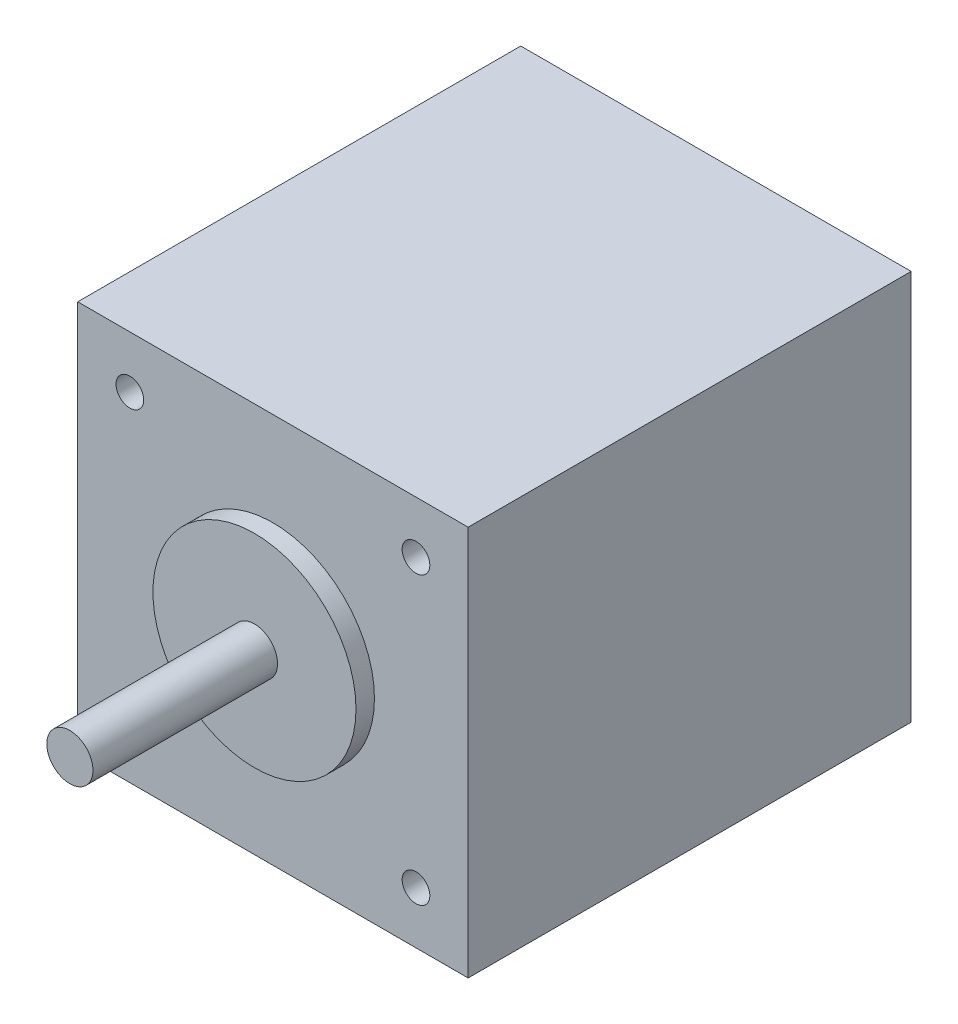
ISO-10303-21;
HEADER;
FILE_DESCRIPTION(('STEP AP214'),'2;1');
FILE_NAME('part.step','',(''),(''),'','','');
FILE_SCHEMA(('AUTOMOTIVE_DESIGN { 1 0 10303 214 1 1 1 1 }'));
ENDSEC;
DATA;
#1=APPLICATION_CONTEXT('core data for automotive mechanical design processes');
#2=APPLICATION_PROTOCOL_DEFINITION('international standard','automotive_design',2000,#1);
#3=PRODUCT_CONTEXT('',#1,'mechanical');
#4=PRODUCT('Part','Part','',(#3));
#5=PRODUCT_RELATED_PRODUCT_CATEGORY('part','',(#4));
#6=PRODUCT_DEFINITION_FORMATION('','',#4);
#7=PRODUCT_DEFINITION_CONTEXT('part definition',#1,'design');
#8=PRODUCT_DEFINITION('design','',#6,#7);
#9=PRODUCT_DEFINITION_SHAPE('','',#8);
#10=(LENGTH_UNIT() NAMED_UNIT(*) SI_UNIT(.MILLI.,.METRE.));
#11=(NAMED_UNIT(*) PLANE_ANGLE_UNIT() SI_UNIT($,.RADIAN.));
#12=(NAMED_UNIT(*) SI_UNIT($,.STERADIAN.) SOLID_ANGLE_UNIT());
#13=UNCERTAINTY_MEASURE_WITH_UNIT(LENGTH_MEASURE(1.E-05),#10,'distance_accuracy_value','');
#14=(GEOMETRIC_REPRESENTATION_CONTEXT(3) GLOBAL_UNCERTAINTY_ASSIGNED_CONTEXT((#13)) GLOBAL_UNIT_ASSIGNED_CONTEXT((#10,
#11,#12)) REPRESENTATION_CONTEXT('',''));
#15=CARTESIAN_POINT('',(0.,0.,0.));
#16=DIRECTION('',(0.,0.,1.));
#17=DIRECTION('',(1.,0.,0.));
#18=AXIS2_PLACEMENT_3D('',#15,#16,#17);
#19=CARTESIAN_POINT('',(0.,0.,22.));
#20=DIRECTION('',(0.,0.,1.));
#21=DIRECTION('',(1.,0.,0.));
#22=AXIS2_PLACEMENT_3D('',#19,#20,#21);
#23=PLANE('',#22);
#24=CARTESIAN_POINT('',(0.,0.,22.));
#25=DIRECTION('',(0.,0.,1.));
#26=DIRECTION('',(1.,0.,0.));
#27=AXIS2_PLACEMENT_3D('',#24,#25,#26);
#28=CIRCLE('',#27,2.5);
#29=CARTESIAN_POINT('',(2.5,0.,22.));
#30=VERTEX_POINT('',#29);
#31=EDGE_CURVE('E20',#30,#30,#28,.F.);
#32=ORIENTED_EDGE('',*,*,#31,.F.);
#33=EDGE_LOOP('',(#32));
#34=FACE_BOUND('',#33,.T.);
#35=ADVANCED_FACE('F17',(#34),#23,.T.);
#36=CARTESIAN_POINT('',(0.,0.,0.));
#37=DIRECTION('',(0.,0.,1.));
#38=DIRECTION('',(1.,0.,0.));
#39=AXIS2_PLACEMENT_3D('',#36,#37,#38);
#40=CYLINDRICAL_SURFACE('',#39,2.5);
#41=CARTESIAN_POINT('',(0.,0.,2.));
#42=DIRECTION('',(0.,0.,1.));
#43=DIRECTION('',(1.,0.,0.));
#44=AXIS2_PLACEMENT_3D('',#41,#42,#43);
#45=CIRCLE('',#44,2.5);
#46=CARTESIAN_POINT('',(2.5,0.,2.));
#47=VERTEX_POINT('',#46);
#48=EDGE_CURVE('E111',#47,#47,#45,.F.);
#49=ORIENTED_EDGE('',*,*,#48,.F.);
#50=EDGE_LOOP('',(#49));
#51=FACE_BOUND('',#50,.T.);
#52=ORIENTED_EDGE('',*,*,#31,.T.);
#53=EDGE_LOOP('',(#52));
#54=FACE_BOUND('',#53,.T.);
#55=ADVANCED_FACE('F118',(#51,#54),#40,.T.);
#56=CARTESIAN_POINT('',(0.,0.,2.));
#57=DIRECTION('',(0.,0.,1.));
#58=DIRECTION('',(1.,0.,0.));
#59=AXIS2_PLACEMENT_3D('',#56,#57,#58);
#60=PLANE('',#59);
#61=ORIENTED_EDGE('',*,*,#48,.T.);
#62=EDGE_LOOP('',(#61));
#63=FACE_BOUND('',#62,.T.);
#64=CARTESIAN_POINT('',(0.,0.,2.));
#65=DIRECTION('',(0.,0.,1.));
#66=DIRECTION('',(1.,0.,0.));
#67=AXIS2_PLACEMENT_3D('',#64,#65,#66);
#68=CIRCLE('',#67,11.);
#69=CARTESIAN_POINT('',(11.,0.,2.));
#70=VERTEX_POINT('',#69);
#71=EDGE_CURVE('E109',#70,#70,#68,.F.);
#72=ORIENTED_EDGE('',*,*,#71,.F.);
#73=EDGE_LOOP('',(#72));
#74=FACE_BOUND('',#73,.T.);
#75=ADVANCED_FACE('F125',(#63,#74),#60,.T.);
#76=CARTESIAN_POINT('',(15.5,15.5,-5.));
#77=DIRECTION('',(0.,0.,1.));
#78=DIRECTION('',(1.,0.,0.));
#79=AXIS2_PLACEMENT_3D('',#76,#77,#78);
#80=PLANE('',#79);
#81=CARTESIAN_POINT('',(15.5,15.5,-5.));
#82=DIRECTION('',(0.,0.,-1.));
#83=DIRECTION('',(-1.,0.,0.));
#84=AXIS2_PLACEMENT_3D('',#81,#82,#83);
#85=CIRCLE('',#84,1.5);
#86=CARTESIAN_POINT('',(14.,15.5,-5.));
#87=VERTEX_POINT('',#86);
#88=EDGE_CURVE('E106',#87,#87,#85,.F.);
#89=ORIENTED_EDGE('',*,*,#88,.T.);
#90=EDGE_LOOP('',(#89));
#91=FACE_BOUND('',#90,.T.);
#92=ADVANCED_FACE('F180',(#91),#80,.T.);
#93=CARTESIAN_POINT('',(15.5,-15.5,-5.));
#94=DIRECTION('',(0.,0.,1.));
#95=DIRECTION('',(1.,0.,0.));
#96=AXIS2_PLACEMENT_3D('',#93,#94,#95);
#97=PLANE('',#96);
#98=CARTESIAN_POINT('',(15.5,-15.5,-5.));
#99=DIRECTION('',(0.,0.,-1.));
#100=DIRECTION('',(-1.,0.,0.));
#101=AXIS2_PLACEMENT_3D('',#98,#99,#100);
#102=CIRCLE('',#101,1.5);
#103=CARTESIAN_POINT('',(14.,-15.5,-5.));
#104=VERTEX_POINT('',#103);
#105=EDGE_CURVE('E103',#104,#104,#102,.F.);
#106=ORIENTED_EDGE('',*,*,#105,.T.);
#107=EDGE_LOOP('',(#106));
#108=FACE_BOUND('',#107,.T.);
#109=ADVANCED_FACE('F176',(#108),#97,.T.);
#110=CARTESIAN_POINT('',(-15.5,15.5,-5.));
#111=DIRECTION('',(0.,0.,1.));
#112=DIRECTION('',(1.,0.,0.));
#113=AXIS2_PLACEMENT_3D('',#110,#111,#112);
#114=PLANE('',#113);
#115=CARTESIAN_POINT('',(-15.5,15.5,-5.));
#116=DIRECTION('',(0.,0.,-1.));
#117=DIRECTION('',(-1.,0.,0.));
#118=AXIS2_PLACEMENT_3D('',#115,#116,#117);
#119=CIRCLE('',#118,1.5);
#120=CARTESIAN_POINT('',(-17.,15.5,-5.));
#121=VERTEX_POINT('',#120);
#122=EDGE_CURVE('E100',#121,#121,#119,.F.);
#123=ORIENTED_EDGE('',*,*,#122,.T.);
#124=EDGE_LOOP('',(#123));
#125=FACE_BOUND('',#124,.T.);
#126=ADVANCED_FACE('F172',(#125),#114,.T.);
#127=CARTESIAN_POINT('',(-15.5,-15.5,-5.));
#128=DIRECTION('',(0.,0.,1.));
#129=DIRECTION('',(1.,0.,0.));
#130=AXIS2_PLACEMENT_3D('',#127,#128,#129);
#131=PLANE('',#130);
#132=CARTESIAN_POINT('',(-15.5,-15.5,-5.));
#133=DIRECTION('',(0.,0.,-1.));
#134=DIRECTION('',(-1.,0.,0.));
#135=AXIS2_PLACEMENT_3D('',#132,#133,#134);
#136=CIRCLE('',#135,1.5);
#137=CARTESIAN_POINT('',(-17.,-15.5,-5.));
#138=VERTEX_POINT('',#137);
#139=EDGE_CURVE('E70',#138,#138,#136,.F.);
#140=ORIENTED_EDGE('',*,*,#139,.T.);
#141=EDGE_LOOP('',(#140));
#142=FACE_BOUND('',#141,.T.);
#143=ADVANCED_FACE('F168',(#142),#131,.T.);
#144=CARTESIAN_POINT('',(0.,0.,0.));
#145=DIRECTION('',(0.,0.,1.));
#146=DIRECTION('',(1.,0.,0.));
#147=AXIS2_PLACEMENT_3D('',#144,#145,#146);
#148=CYLINDRICAL_SURFACE('',#147,11.);
#149=CARTESIAN_POINT('',(0.,0.,0.));
#150=DIRECTION('',(0.,0.,1.));
#151=DIRECTION('',(1.,0.,0.));
#152=AXIS2_PLACEMENT_3D('',#149,#150,#151);
#153=CIRCLE('',#152,11.);
#154=CARTESIAN_POINT('',(11.,0.,0.));
#155=VERTEX_POINT('',#154);
#156=EDGE_CURVE('E69',#155,#155,#153,.F.);
#157=ORIENTED_EDGE('',*,*,#156,.F.);
#158=EDGE_LOOP('',(#157));
#159=FACE_BOUND('',#158,.T.);
#160=ORIENTED_EDGE('',*,*,#71,.T.);
#161=EDGE_LOOP('',(#160));
#162=FACE_BOUND('',#161,.T.);
#163=ADVANCED_FACE('F164',(#159,#162),#148,.T.);
#164=CARTESIAN_POINT('',(15.5,15.5,0.));
#165=DIRECTION('',(0.,0.,-1.));
#166=DIRECTION('',(-1.,0.,0.));
#167=AXIS2_PLACEMENT_3D('',#164,#165,#166);
#168=CYLINDRICAL_SURFACE('',#167,1.5);
#169=ORIENTED_EDGE('',*,*,#88,.F.);
#170=EDGE_LOOP('',(#169));
#171=FACE_BOUND('',#170,.T.);
#172=CARTESIAN_POINT('',(15.5,15.5,0.));
#173=DIRECTION('',(0.,0.,-1.));
#174=DIRECTION('',(-1.,0.,0.));
#175=AXIS2_PLACEMENT_3D('',#172,#173,#174);
#176=CIRCLE('',#175,1.5);
#177=CARTESIAN_POINT('',(14.,15.5,0.));
#178=VERTEX_POINT('',#177);
#179=EDGE_CURVE('E93',#178,#178,#176,.T.);
#180=ORIENTED_EDGE('',*,*,#179,.F.);
#181=EDGE_LOOP('',(#180));
#182=FACE_BOUND('',#181,.T.);
#183=ADVANCED_FACE('F160',(#171,#182),#168,.F.);
#184=CARTESIAN_POINT('',(15.5,-15.5,0.));
#185=DIRECTION('',(0.,0.,-1.));
#186=DIRECTION('',(-1.,0.,0.));
#187=AXIS2_PLACEMENT_3D('',#184,#185,#186);
#188=CYLINDRICAL_SURFACE('',#187,1.5);
#189=ORIENTED_EDGE('',*,*,#105,.F.);
#190=EDGE_LOOP('',(#189));
#191=FACE_BOUND('',#190,.T.);
#192=CARTESIAN_POINT('',(15.5,-15.5,0.));
#193=DIRECTION('',(0.,0.,-1.));
#194=DIRECTION('',(-1.,0.,0.));
#195=AXIS2_PLACEMENT_3D('',#192,#193,#194);
#196=CIRCLE('',#195,1.5);
#197=CARTESIAN_POINT('',(14.,-15.5,0.));
#198=VERTEX_POINT('',#197);
#199=EDGE_CURVE('E90',#198,#198,#196,.T.);
#200=ORIENTED_EDGE('',*,*,#199,.F.);
#201=EDGE_LOOP('',(#200));
#202=FACE_BOUND('',#201,.T.);
#203=ADVANCED_FACE('F156',(#191,#202),#188,.F.);
#204=CARTESIAN_POINT('',(-15.5,15.5,0.));
#205=DIRECTION('',(0.,0.,-1.));
#206=DIRECTION('',(-1.,0.,0.));
#207=AXIS2_PLACEMENT_3D('',#204,#205,#206);
#208=CYLINDRICAL_SURFACE('',#207,1.5);
#209=ORIENTED_EDGE('',*,*,#122,.F.);
#210=EDGE_LOOP('',(#209));
#211=FACE_BOUND('',#210,.T.);
#212=CARTESIAN_POINT('',(-15.5,15.5,0.));
#213=DIRECTION('',(0.,0.,-1.));
#214=DIRECTION('',(-1.,0.,0.));
#215=AXIS2_PLACEMENT_3D('',#212,#213,#214);
#216=CIRCLE('',#215,1.5);
#217=CARTESIAN_POINT('',(-17.,15.5,0.));
#218=VERTEX_POINT('',#217);
#219=EDGE_CURVE('E84',#218,#218,#216,.T.);
#220=ORIENTED_EDGE('',*,*,#219,.F.);
#221=EDGE_LOOP('',(#220));
#222=FACE_BOUND('',#221,.T.);
#223=ADVANCED_FACE('F152',(#211,#222),#208,.F.);
#224=CARTESIAN_POINT('',(-15.5,-15.5,0.));
#225=DIRECTION('',(0.,0.,-1.));
#226=DIRECTION('',(-1.,0.,0.));
#227=AXIS2_PLACEMENT_3D('',#224,#225,#226);
#228=CYLINDRICAL_SURFACE('',#227,1.5);
#229=ORIENTED_EDGE('',*,*,#139,.F.);
#230=EDGE_LOOP('',(#229));
#231=FACE_BOUND('',#230,.T.);
#232=CARTESIAN_POINT('',(-15.5,-15.5,0.));
#233=DIRECTION('',(0.,0.,-1.));
#234=DIRECTION('',(-1.,0.,0.));
#235=AXIS2_PLACEMENT_3D('',#232,#233,#234);
#236=CIRCLE('',#235,1.5);
#237=CARTESIAN_POINT('',(-17.,-15.5,0.));
#238=VERTEX_POINT('',#237);
#239=EDGE_CURVE('E81',#238,#238,#236,.T.);
#240=ORIENTED_EDGE('',*,*,#239,.F.);
#241=EDGE_LOOP('',(#240));
#242=FACE_BOUND('',#241,.T.);
#243=ADVANCED_FACE('F149',(#231,#242),#228,.F.);
#244=CARTESIAN_POINT('',(21.15,21.15,0.));
#245=DIRECTION('',(1.,0.,0.));
#246=DIRECTION('',(0.,0.,-1.));
#247=AXIS2_PLACEMENT_3D('',#244,#245,#246);
#248=PLANE('',#247);
#249=DIRECTION('',(0.,1.,0.));
#250=VECTOR('',#249,1.);
#251=CARTESIAN_POINT('',(21.15,0.,-48.));
#252=LINE('',#251,#250);
#253=CARTESIAN_POINT('',(21.15,21.15,-48.));
#254=VERTEX_POINT('',#253);
#255=CARTESIAN_POINT('',(21.15,-21.15,-48.));
#256=VERTEX_POINT('',#255);
#257=EDGE_CURVE('E73',#254,#256,#252,.F.);
#258=ORIENTED_EDGE('',*,*,#257,.F.);
#259=DIRECTION('',(0.,0.,1.));
#260=VECTOR('',#259,1.);
#261=CARTESIAN_POINT('',(21.15,21.15,0.));
#262=LINE('',#261,#260);
#263=CARTESIAN_POINT('',(21.15,21.15,0.));
#264=VERTEX_POINT('',#263);
#265=EDGE_CURVE('E55',#264,#254,#262,.F.);
#266=ORIENTED_EDGE('',*,*,#265,.F.);
#267=DIRECTION('',(0.,1.,0.));
#268=VECTOR('',#267,1.);
#269=CARTESIAN_POINT('',(21.15,0.,0.));
#270=LINE('',#269,#268);
#271=CARTESIAN_POINT('',(21.15,-21.15,0.));
#272=VERTEX_POINT('',#271);
#273=EDGE_CURVE('E60',#272,#264,#270,.T.);
#274=ORIENTED_EDGE('',*,*,#273,.F.);
#275=DIRECTION('',(0.,0.,-1.));
#276=VECTOR('',#275,1.);
#277=CARTESIAN_POINT('',(21.15,-21.15,0.));
#278=LINE('',#277,#276);
#279=EDGE_CURVE('E322',#256,#272,#278,.F.);
#280=ORIENTED_EDGE('',*,*,#279,.F.);
#281=EDGE_LOOP('',(#258,#266,#274,#280));
#282=FACE_BOUND('',#281,.T.);
#283=ADVANCED_FACE('F72',(#282),#248,.T.);
#284=CARTESIAN_POINT('',(0.,0.,0.));
#285=DIRECTION('',(0.,0.,1.));
#286=DIRECTION('',(1.,0.,0.));
#287=AXIS2_PLACEMENT_3D('',#284,#285,#286);
#288=PLANE('',#287);
#289=ORIENTED_EDGE('',*,*,#239,.T.);
#290=EDGE_LOOP('',(#289));
#291=FACE_BOUND('',#290,.T.);
#292=ORIENTED_EDGE('',*,*,#219,.T.);
#293=EDGE_LOOP('',(#292));
#294=FACE_BOUND('',#293,.T.);
#295=ORIENTED_EDGE('',*,*,#199,.T.);
#296=EDGE_LOOP('',(#295));
#297=FACE_BOUND('',#296,.T.);
#298=ORIENTED_EDGE('',*,*,#179,.T.);
#299=EDGE_LOOP('',(#298));
#300=FACE_BOUND('',#299,.T.);
#301=ORIENTED_EDGE('',*,*,#156,.T.);
#302=EDGE_LOOP('',(#301));
#303=FACE_BOUND('',#302,.T.);
#304=DIRECTION('',(1.,0.,0.));
#305=VECTOR('',#304,1.);
#306=CARTESIAN_POINT('',(21.15,-21.15,0.));
#307=LINE('',#306,#305);
#308=CARTESIAN_POINT('',(-21.15,-21.15,0.));
#309=VERTEX_POINT('',#308);
#310=EDGE_CURVE('E65',#272,#309,#307,.F.);
#311=ORIENTED_EDGE('',*,*,#310,.F.);
#312=ORIENTED_EDGE('',*,*,#273,.T.);
#313=DIRECTION('',(1.,0.,0.));
#314=VECTOR('',#313,1.);
#315=CARTESIAN_POINT('',(-21.15,21.15,0.));
#316=LINE('',#315,#314);
#317=CARTESIAN_POINT('',(-21.15,21.15,0.));
#318=VERTEX_POINT('',#317);
#319=EDGE_CURVE('E62',#318,#264,#316,.T.);
#320=ORIENTED_EDGE('',*,*,#319,.F.);
#321=DIRECTION('',(0.,1.,0.));
#322=VECTOR('',#321,1.);
#323=CARTESIAN_POINT('',(-21.15,-21.15,0.));
#324=LINE('',#323,#322);
#325=EDGE_CURVE('E318',#309,#318,#324,.T.);
#326=ORIENTED_EDGE('',*,*,#325,.F.);
#327=EDGE_LOOP('',(#311,#312,#320,#326));
#328=FACE_BOUND('',#327,.T.);
#329=ADVANCED_FACE('F61',(#291,#294,#297,#300,#303,#328),#288,.T.);
#330=CARTESIAN_POINT('',(-21.15,21.15,0.));
#331=DIRECTION('',(0.,1.,0.));
#332=DIRECTION('',(0.,0.,1.));
#333=AXIS2_PLACEMENT_3D('',#330,#331,#332);
#334=PLANE('',#333);
#335=DIRECTION('',(-1.,0.,0.));
#336=VECTOR('',#335,1.);
#337=CARTESIAN_POINT('',(0.,21.15,-48.));
#338=LINE('',#337,#336);
#339=CARTESIAN_POINT('',(-21.15,21.15,-48.));
#340=VERTEX_POINT('',#339);
#341=EDGE_CURVE('E75',#340,#254,#338,.F.);
#342=ORIENTED_EDGE('',*,*,#341,.F.);
#343=DIRECTION('',(0.,0.,1.));
#344=VECTOR('',#343,1.);
#345=CARTESIAN_POINT('',(-21.15,21.15,0.));
#346=LINE('',#345,#344);
#347=EDGE_CURVE('E79',#318,#340,#346,.F.);
#348=ORIENTED_EDGE('',*,*,#347,.F.);
#349=ORIENTED_EDGE('',*,*,#319,.T.);
#350=ORIENTED_EDGE('',*,*,#265,.T.);
#351=EDGE_LOOP('',(#342,#348,#349,#350));
#352=FACE_BOUND('',#351,.T.);
#353=ADVANCED_FACE('F77',(#352),#334,.T.);
#354=CARTESIAN_POINT('',(0.,0.,-48.));
#355=DIRECTION('',(0.,0.,-1.));
#356=DIRECTION('',(-1.,0.,0.));
#357=AXIS2_PLACEMENT_3D('',#354,#355,#356);
#358=PLANE('',#357);
#359=DIRECTION('',(1.,0.,0.));
#360=VECTOR('',#359,1.);
#361=CARTESIAN_POINT('',(21.15,-21.15,-48.));
#362=LINE('',#361,#360);
#363=CARTESIAN_POINT('',(-21.15,-21.15,-48.));
#364=VERTEX_POINT('',#363);
#365=EDGE_CURVE('E35',#364,#256,#362,.T.);
#366=ORIENTED_EDGE('',*,*,#365,.F.);
#367=DIRECTION('',(0.,1.,0.));
#368=VECTOR('',#367,1.);
#369=CARTESIAN_POINT('',(-21.15,-21.15,-48.));
#370=LINE('',#369,#368);
#371=EDGE_CURVE('E26',#340,#364,#370,.F.);
#372=ORIENTED_EDGE('',*,*,#371,.F.);
#373=ORIENTED_EDGE('',*,*,#341,.T.);
#374=ORIENTED_EDGE('',*,*,#257,.T.);
#375=EDGE_LOOP('',(#366,#372,#373,#374));
#376=FACE_BOUND('',#375,.T.);
#377=ADVANCED_FACE('F135',(#376),#358,.T.);
#378=CARTESIAN_POINT('',(21.15,-21.15,0.));
#379=DIRECTION('',(0.,-1.,0.));
#380=DIRECTION('',(0.,0.,-1.));
#381=AXIS2_PLACEMENT_3D('',#378,#379,#380);
#382=PLANE('',#381);
#383=ORIENTED_EDGE('',*,*,#365,.T.);
#384=ORIENTED_EDGE('',*,*,#279,.T.);
#385=ORIENTED_EDGE('',*,*,#310,.T.);
#386=DIRECTION('',(0.,0.,1.));
#387=VECTOR('',#386,1.);
#388=CARTESIAN_POINT('',(-21.15,-21.15,0.));
#389=LINE('',#388,#387);
#390=EDGE_CURVE('E11',#364,#309,#389,.T.);
#391=ORIENTED_EDGE('',*,*,#390,.F.);
#392=EDGE_LOOP('',(#383,#384,#385,#391));
#393=FACE_BOUND('',#392,.T.);
#394=ADVANCED_FACE('F129',(#393),#382,.T.);
#395=CARTESIAN_POINT('',(-21.15,-21.15,0.));
#396=DIRECTION('',(-1.,0.,0.));
#397=DIRECTION('',(0.,0.,1.));
#398=AXIS2_PLACEMENT_3D('',#395,#396,#397);
#399=PLANE('',#398);
#400=ORIENTED_EDGE('',*,*,#371,.T.);
#401=ORIENTED_EDGE('',*,*,#390,.T.);
#402=ORIENTED_EDGE('',*,*,#325,.T.);
#403=ORIENTED_EDGE('',*,*,#347,.T.);
#404=EDGE_LOOP('',(#400,#401,#402,#403));
#405=FACE_BOUND('',#404,.T.);
#406=ADVANCED_FACE('F127',(#405),#399,.T.);
#407=CLOSED_SHELL('',(#35,#55,#75,#92,#109,#126,#143,#163,#183,#203,#223,#243,#283,#329,#353,
#377,#394,#406));
#408=MANIFOLD_SOLID_BREP('B1',#407);
#409=ADVANCED_BREP_SHAPE_REPRESENTATION('',(#18,#408),#14);
#410=SHAPE_DEFINITION_REPRESENTATION(#9,#409);
ENDSEC;
END-ISO-10303-21;
